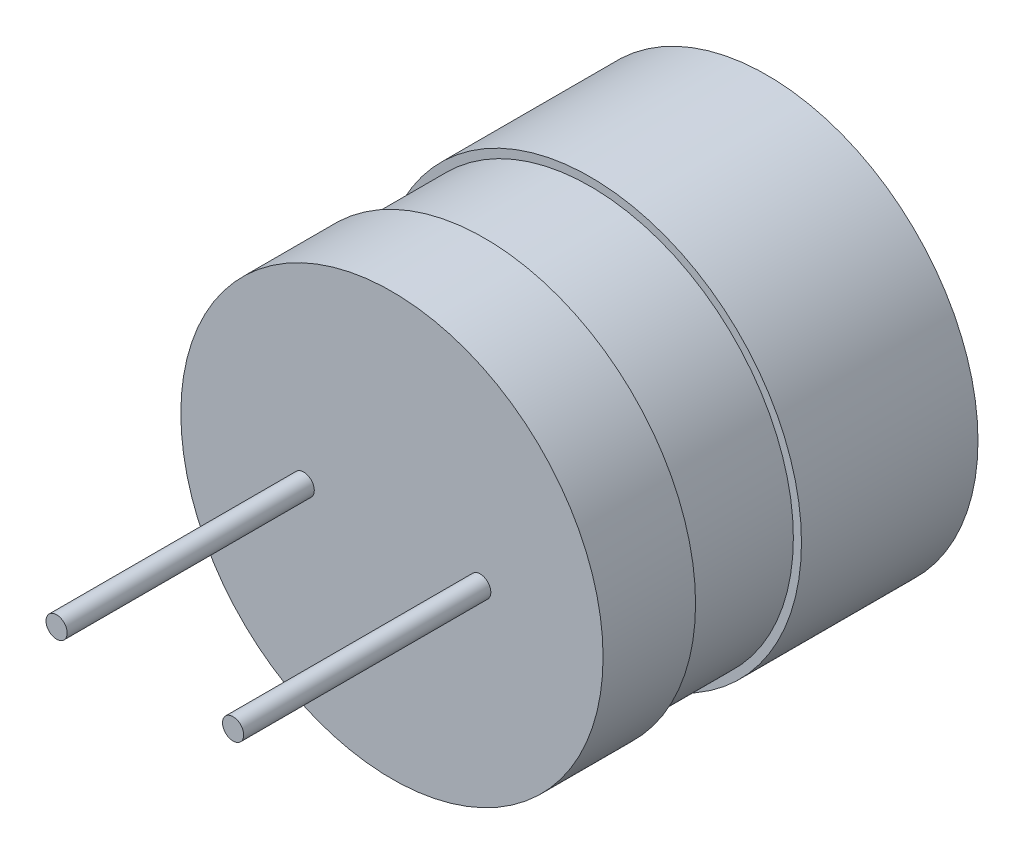
ISO-10303-21;
HEADER;
FILE_DESCRIPTION(('STEP AP214'),'2;1');
FILE_NAME('part.step','',(''),(''),'','','');
FILE_SCHEMA(('AUTOMOTIVE_DESIGN { 1 0 10303 214 1 1 1 1 }'));
ENDSEC;
DATA;
#1=APPLICATION_CONTEXT('core data for automotive mechanical design processes');
#2=APPLICATION_PROTOCOL_DEFINITION('international standard','automotive_design',2000,#1);
#3=PRODUCT_CONTEXT('',#1,'mechanical');
#4=PRODUCT('Part','Part','',(#3));
#5=PRODUCT_RELATED_PRODUCT_CATEGORY('part','',(#4));
#6=PRODUCT_DEFINITION_FORMATION('','',#4);
#7=PRODUCT_DEFINITION_CONTEXT('part definition',#1,'design');
#8=PRODUCT_DEFINITION('design','',#6,#7);
#9=PRODUCT_DEFINITION_SHAPE('','',#8);
#10=(LENGTH_UNIT() NAMED_UNIT(*) SI_UNIT(.MILLI.,.METRE.));
#11=(NAMED_UNIT(*) PLANE_ANGLE_UNIT() SI_UNIT($,.RADIAN.));
#12=(NAMED_UNIT(*) SI_UNIT($,.STERADIAN.) SOLID_ANGLE_UNIT());
#13=UNCERTAINTY_MEASURE_WITH_UNIT(LENGTH_MEASURE(1.E-05),#10,'distance_accuracy_value','');
#14=(GEOMETRIC_REPRESENTATION_CONTEXT(3) GLOBAL_UNCERTAINTY_ASSIGNED_CONTEXT((#13)) GLOBAL_UNIT_ASSIGNED_CONTEXT((#10,
#11,#12)) REPRESENTATION_CONTEXT('',''));
#15=CARTESIAN_POINT('',(0.,0.,0.));
#16=DIRECTION('',(0.,0.,1.));
#17=DIRECTION('',(1.,0.,0.));
#18=AXIS2_PLACEMENT_3D('',#15,#16,#17);
#19=CARTESIAN_POINT('',(0.,0.,5.));
#20=DIRECTION('',(0.,0.,-1.));
#21=DIRECTION('',(-1.,0.,0.));
#22=AXIS2_PLACEMENT_3D('',#19,#20,#21);
#23=CYLINDRICAL_SURFACE('',#22,5.98);
#24=CARTESIAN_POINT('',(0.,0.,5.));
#25=DIRECTION('',(0.,0.,1.));
#26=DIRECTION('',(1.,0.,0.));
#27=AXIS2_PLACEMENT_3D('',#24,#25,#26);
#28=CIRCLE('',#27,5.98);
#29=CARTESIAN_POINT('',(5.98,0.,5.));
#30=VERTEX_POINT('',#29);
#31=EDGE_CURVE('E54',#30,#30,#28,.T.);
#32=ORIENTED_EDGE('',*,*,#31,.F.);
#33=EDGE_LOOP('',(#32));
#34=FACE_BOUND('',#33,.T.);
#35=CARTESIAN_POINT('',(0.,0.,0.));
#36=DIRECTION('',(0.,0.,1.));
#37=DIRECTION('',(1.,0.,0.));
#38=AXIS2_PLACEMENT_3D('',#35,#36,#37);
#39=CIRCLE('',#38,5.98);
#40=CARTESIAN_POINT('',(5.98,0.,0.));
#41=VERTEX_POINT('',#40);
#42=EDGE_CURVE('E49',#41,#41,#39,.T.);
#43=ORIENTED_EDGE('',*,*,#42,.T.);
#44=EDGE_LOOP('',(#43));
#45=FACE_BOUND('',#44,.T.);
#46=ADVANCED_FACE('F46',(#34,#45),#23,.T.);
#47=CARTESIAN_POINT('',(0.,0.,5.));
#48=DIRECTION('',(0.,0.,1.));
#49=DIRECTION('',(1.,0.,0.));
#50=AXIS2_PLACEMENT_3D('',#47,#48,#49);
#51=PLANE('',#50);
#52=CARTESIAN_POINT('',(0.,0.,5.));
#53=DIRECTION('',(0.,0.,1.));
#54=DIRECTION('',(1.,0.,0.));
#55=AXIS2_PLACEMENT_3D('',#52,#53,#54);
#56=CIRCLE('',#55,5.75);
#57=CARTESIAN_POINT('',(5.75,0.,5.));
#58=VERTEX_POINT('',#57);
#59=EDGE_CURVE('E10',#58,#58,#56,.T.);
#60=ORIENTED_EDGE('',*,*,#59,.F.);
#61=EDGE_LOOP('',(#60));
#62=FACE_BOUND('',#61,.T.);
#63=ORIENTED_EDGE('',*,*,#31,.T.);
#64=EDGE_LOOP('',(#63));
#65=FACE_BOUND('',#64,.T.);
#66=ADVANCED_FACE('F134',(#62,#65),#51,.T.);
#67=CARTESIAN_POINT('',(0.,0.,0.));
#68=DIRECTION('',(0.,0.,1.));
#69=DIRECTION('',(1.,0.,0.));
#70=AXIS2_PLACEMENT_3D('',#67,#68,#69);
#71=PLANE('',#70);
#72=CARTESIAN_POINT('',(0.,0.,0.));
#73=DIRECTION('',(0.,0.,-1.));
#74=DIRECTION('',(-1.,0.,0.));
#75=AXIS2_PLACEMENT_3D('',#72,#73,#74);
#76=CIRCLE('',#75,1.25);
#77=CARTESIAN_POINT('',(-1.25,0.,0.));
#78=VERTEX_POINT('',#77);
#79=EDGE_CURVE('E70',#78,#78,#76,.T.);
#80=ORIENTED_EDGE('',*,*,#79,.F.);
#81=EDGE_LOOP('',(#80));
#82=FACE_BOUND('',#81,.T.);
#83=ORIENTED_EDGE('',*,*,#42,.F.);
#84=EDGE_LOOP('',(#83));
#85=FACE_BOUND('',#84,.T.);
#86=ADVANCED_FACE('F139',(#82,#85),#71,.F.);
#87=CARTESIAN_POINT('',(0.,0.,5.));
#88=DIRECTION('',(0.,0.,-1.));
#89=DIRECTION('',(-1.,0.,0.));
#90=AXIS2_PLACEMENT_3D('',#87,#88,#89);
#91=CYLINDRICAL_SURFACE('',#90,1.25);
#92=CARTESIAN_POINT('',(0.,0.,5.));
#93=DIRECTION('',(0.,0.,-1.));
#94=DIRECTION('',(-1.,0.,0.));
#95=AXIS2_PLACEMENT_3D('',#92,#93,#94);
#96=CIRCLE('',#95,1.25);
#97=CARTESIAN_POINT('',(-1.25,0.,5.));
#98=VERTEX_POINT('',#97);
#99=EDGE_CURVE('E66',#98,#98,#96,.T.);
#100=ORIENTED_EDGE('',*,*,#99,.F.);
#101=EDGE_LOOP('',(#100));
#102=FACE_BOUND('',#101,.T.);
#103=ORIENTED_EDGE('',*,*,#79,.T.);
#104=EDGE_LOOP('',(#103));
#105=FACE_BOUND('',#104,.T.);
#106=ADVANCED_FACE('F163',(#102,#105),#91,.F.);
#107=CARTESIAN_POINT('',(0.,0.,8.));
#108=DIRECTION('',(0.,0.,-1.));
#109=DIRECTION('',(-1.,0.,0.));
#110=AXIS2_PLACEMENT_3D('',#107,#108,#109);
#111=CYLINDRICAL_SURFACE('',#110,5.75);
#112=CARTESIAN_POINT('',(0.,0.,8.));
#113=DIRECTION('',(0.,0.,1.));
#114=DIRECTION('',(1.,0.,0.));
#115=AXIS2_PLACEMENT_3D('',#112,#113,#114);
#116=CIRCLE('',#115,5.75);
#117=CARTESIAN_POINT('',(5.75,0.,8.));
#118=VERTEX_POINT('',#117);
#119=EDGE_CURVE('E64',#118,#118,#116,.T.);
#120=ORIENTED_EDGE('',*,*,#119,.F.);
#121=EDGE_LOOP('',(#120));
#122=FACE_BOUND('',#121,.T.);
#123=ORIENTED_EDGE('',*,*,#59,.T.);
#124=EDGE_LOOP('',(#123));
#125=FACE_BOUND('',#124,.T.);
#126=ADVANCED_FACE('F168',(#122,#125),#111,.T.);
#127=CARTESIAN_POINT('',(0.,0.,5.));
#128=DIRECTION('',(0.,0.,1.));
#129=DIRECTION('',(1.,0.,0.));
#130=AXIS2_PLACEMENT_3D('',#127,#128,#129);
#131=PLANE('',#130);
#132=ORIENTED_EDGE('',*,*,#99,.T.);
#133=EDGE_LOOP('',(#132));
#134=FACE_BOUND('',#133,.T.);
#135=ADVANCED_FACE('F128',(#134),#131,.F.);
#136=CARTESIAN_POINT('',(0.,0.,10.62));
#137=DIRECTION('',(0.,0.,-1.));
#138=DIRECTION('',(-1.,0.,0.));
#139=AXIS2_PLACEMENT_3D('',#136,#137,#138);
#140=CYLINDRICAL_SURFACE('',#139,5.98);
#141=CARTESIAN_POINT('',(0.,0.,10.62));
#142=DIRECTION('',(0.,0.,1.));
#143=DIRECTION('',(1.,0.,0.));
#144=AXIS2_PLACEMENT_3D('',#141,#142,#143);
#145=CIRCLE('',#144,5.98);
#146=CARTESIAN_POINT('',(5.98,0.,10.62));
#147=VERTEX_POINT('',#146);
#148=EDGE_CURVE('E79',#147,#147,#145,.T.);
#149=ORIENTED_EDGE('',*,*,#148,.F.);
#150=EDGE_LOOP('',(#149));
#151=FACE_BOUND('',#150,.T.);
#152=CARTESIAN_POINT('',(0.,0.,8.));
#153=DIRECTION('',(0.,0.,1.));
#154=DIRECTION('',(1.,0.,0.));
#155=AXIS2_PLACEMENT_3D('',#152,#153,#154);
#156=CIRCLE('',#155,5.98);
#157=CARTESIAN_POINT('',(5.98,0.,8.));
#158=VERTEX_POINT('',#157);
#159=EDGE_CURVE('E86',#158,#158,#156,.T.);
#160=ORIENTED_EDGE('',*,*,#159,.T.);
#161=EDGE_LOOP('',(#160));
#162=FACE_BOUND('',#161,.T.);
#163=ADVANCED_FACE('F120',(#151,#162),#140,.T.);
#164=CARTESIAN_POINT('',(0.,0.,10.62));
#165=DIRECTION('',(0.,0.,1.));
#166=DIRECTION('',(1.,0.,0.));
#167=AXIS2_PLACEMENT_3D('',#164,#165,#166);
#168=PLANE('',#167);
#169=ORIENTED_EDGE('',*,*,#148,.T.);
#170=EDGE_LOOP('',(#169));
#171=FACE_BOUND('',#170,.T.);
#172=CARTESIAN_POINT('',(2.5,0.,10.62));
#173=DIRECTION('',(0.,0.,1.));
#174=DIRECTION('',(1.,0.,0.));
#175=AXIS2_PLACEMENT_3D('',#172,#173,#174);
#176=CIRCLE('',#175,0.3);
#177=CARTESIAN_POINT('',(2.8,0.,10.62));
#178=VERTEX_POINT('',#177);
#179=EDGE_CURVE('E100',#178,#178,#176,.T.);
#180=ORIENTED_EDGE('',*,*,#179,.F.);
#181=EDGE_LOOP('',(#180));
#182=FACE_BOUND('',#181,.T.);
#183=CARTESIAN_POINT('',(-2.5,0.,10.62));
#184=DIRECTION('',(0.,0.,1.));
#185=DIRECTION('',(1.,0.,0.));
#186=AXIS2_PLACEMENT_3D('',#183,#184,#185);
#187=CIRCLE('',#186,0.3);
#188=CARTESIAN_POINT('',(-2.2,0.,10.62));
#189=VERTEX_POINT('',#188);
#190=EDGE_CURVE('E94',#189,#189,#187,.T.);
#191=ORIENTED_EDGE('',*,*,#190,.F.);
#192=EDGE_LOOP('',(#191));
#193=FACE_BOUND('',#192,.T.);
#194=ADVANCED_FACE('F117',(#171,#182,#193),#168,.T.);
#195=CARTESIAN_POINT('',(0.,0.,8.));
#196=DIRECTION('',(0.,0.,1.));
#197=DIRECTION('',(1.,0.,0.));
#198=AXIS2_PLACEMENT_3D('',#195,#196,#197);
#199=PLANE('',#198);
#200=ORIENTED_EDGE('',*,*,#119,.T.);
#201=EDGE_LOOP('',(#200));
#202=FACE_BOUND('',#201,.T.);
#203=ORIENTED_EDGE('',*,*,#159,.F.);
#204=EDGE_LOOP('',(#203));
#205=FACE_BOUND('',#204,.T.);
#206=ADVANCED_FACE('F119',(#202,#205),#199,.F.);
#207=CARTESIAN_POINT('',(2.5,0.,10.62));
#208=DIRECTION('',(0.,0.,1.));
#209=DIRECTION('',(1.,0.,0.));
#210=AXIS2_PLACEMENT_3D('',#207,#208,#209);
#211=CYLINDRICAL_SURFACE('',#210,0.3);
#212=ORIENTED_EDGE('',*,*,#179,.T.);
#213=EDGE_LOOP('',(#212));
#214=FACE_BOUND('',#213,.T.);
#215=CARTESIAN_POINT('',(2.5,0.,17.62));
#216=DIRECTION('',(0.,0.,1.));
#217=DIRECTION('',(1.,0.,0.));
#218=AXIS2_PLACEMENT_3D('',#215,#216,#217);
#219=CIRCLE('',#218,0.3);
#220=CARTESIAN_POINT('',(2.8,0.,17.62));
#221=VERTEX_POINT('',#220);
#222=EDGE_CURVE('E96',#221,#221,#219,.T.);
#223=ORIENTED_EDGE('',*,*,#222,.F.);
#224=EDGE_LOOP('',(#223));
#225=FACE_BOUND('',#224,.T.);
#226=ADVANCED_FACE('F126',(#214,#225),#211,.T.);
#227=CARTESIAN_POINT('',(-2.5,0.,10.62));
#228=DIRECTION('',(0.,0.,1.));
#229=DIRECTION('',(1.,0.,0.));
#230=AXIS2_PLACEMENT_3D('',#227,#228,#229);
#231=CYLINDRICAL_SURFACE('',#230,0.3);
#232=ORIENTED_EDGE('',*,*,#190,.T.);
#233=EDGE_LOOP('',(#232));
#234=FACE_BOUND('',#233,.T.);
#235=CARTESIAN_POINT('',(-2.5,0.,17.62));
#236=DIRECTION('',(0.,0.,1.));
#237=DIRECTION('',(1.,0.,0.));
#238=AXIS2_PLACEMENT_3D('',#235,#236,#237);
#239=CIRCLE('',#238,0.3);
#240=CARTESIAN_POINT('',(-2.2,0.,17.62));
#241=VERTEX_POINT('',#240);
#242=EDGE_CURVE('E104',#241,#241,#239,.T.);
#243=ORIENTED_EDGE('',*,*,#242,.F.);
#244=EDGE_LOOP('',(#243));
#245=FACE_BOUND('',#244,.T.);
#246=ADVANCED_FACE('F114',(#234,#245),#231,.T.);
#247=CARTESIAN_POINT('',(2.5,0.,17.62));
#248=DIRECTION('',(0.,0.,1.));
#249=DIRECTION('',(1.,0.,0.));
#250=AXIS2_PLACEMENT_3D('',#247,#248,#249);
#251=PLANE('',#250);
#252=ORIENTED_EDGE('',*,*,#222,.T.);
#253=EDGE_LOOP('',(#252));
#254=FACE_BOUND('',#253,.T.);
#255=ADVANCED_FACE('F214',(#254),#251,.T.);
#256=CARTESIAN_POINT('',(-2.5,0.,17.62));
#257=DIRECTION('',(0.,0.,1.));
#258=DIRECTION('',(1.,0.,0.));
#259=AXIS2_PLACEMENT_3D('',#256,#257,#258);
#260=PLANE('',#259);
#261=ORIENTED_EDGE('',*,*,#242,.T.);
#262=EDGE_LOOP('',(#261));
#263=FACE_BOUND('',#262,.T.);
#264=ADVANCED_FACE('F223',(#263),#260,.T.);
#265=CLOSED_SHELL('',(#46,#66,#86,#106,#126,#135,#163,#194,#206,#226,#246,#255,#264));
#266=MANIFOLD_SOLID_BREP('B2',#265);
#267=ADVANCED_BREP_SHAPE_REPRESENTATION('',(#18,#266),#14);
#268=SHAPE_DEFINITION_REPRESENTATION(#9,#267);
ENDSEC;
END-ISO-10303-21;
